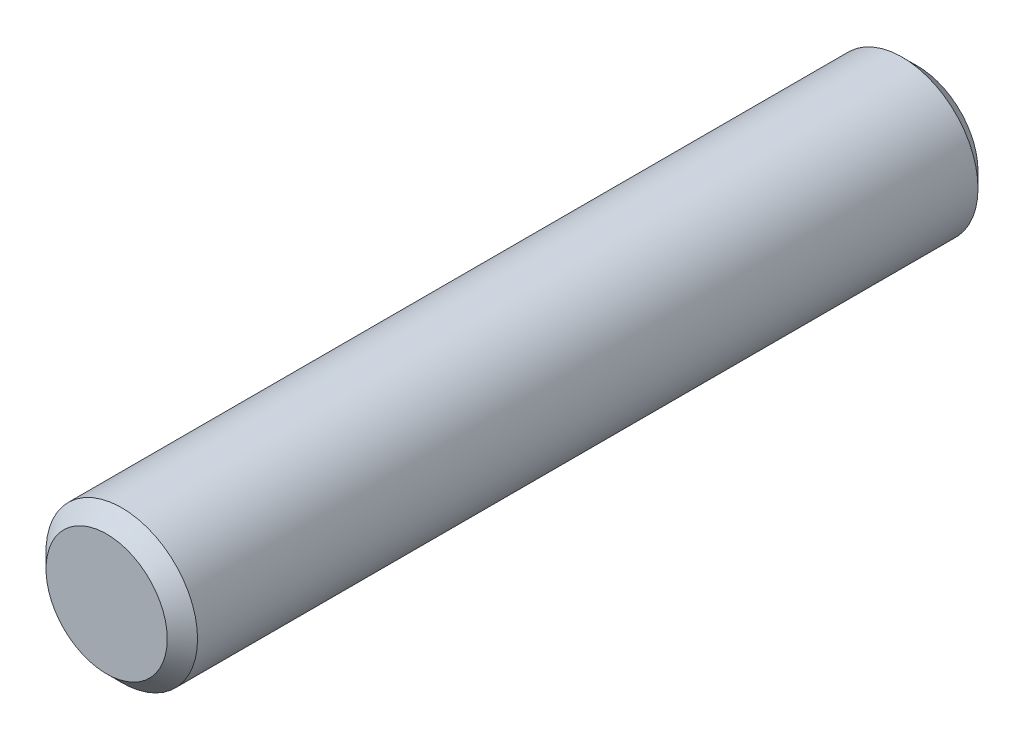
ISO-10303-21;
HEADER;
FILE_DESCRIPTION(('STEP AP214'),'2;1');
FILE_NAME('part.step','',(''),(''),'','','');
FILE_SCHEMA(('AUTOMOTIVE_DESIGN { 1 0 10303 214 1 1 1 1 }'));
ENDSEC;
DATA;
#1=APPLICATION_CONTEXT('core data for automotive mechanical design processes');
#2=APPLICATION_PROTOCOL_DEFINITION('international standard','automotive_design',2000,#1);
#3=PRODUCT_CONTEXT('',#1,'mechanical');
#4=PRODUCT('Part','Part','',(#3));
#5=PRODUCT_RELATED_PRODUCT_CATEGORY('part','',(#4));
#6=PRODUCT_DEFINITION_FORMATION('','',#4);
#7=PRODUCT_DEFINITION_CONTEXT('part definition',#1,'design');
#8=PRODUCT_DEFINITION('design','',#6,#7);
#9=PRODUCT_DEFINITION_SHAPE('','',#8);
#10=(LENGTH_UNIT() NAMED_UNIT(*) SI_UNIT(.MILLI.,.METRE.));
#11=(NAMED_UNIT(*) PLANE_ANGLE_UNIT() SI_UNIT($,.RADIAN.));
#12=(NAMED_UNIT(*) SI_UNIT($,.STERADIAN.) SOLID_ANGLE_UNIT());
#13=UNCERTAINTY_MEASURE_WITH_UNIT(LENGTH_MEASURE(1.E-05),#10,'distance_accuracy_value','');
#14=(GEOMETRIC_REPRESENTATION_CONTEXT(3) GLOBAL_UNCERTAINTY_ASSIGNED_CONTEXT((#13)) GLOBAL_UNIT_ASSIGNED_CONTEXT((#10,
#11,#12)) REPRESENTATION_CONTEXT('',''));
#15=CARTESIAN_POINT('',(0.,0.,0.));
#16=DIRECTION('',(0.,0.,1.));
#17=DIRECTION('',(1.,0.,0.));
#18=AXIS2_PLACEMENT_3D('',#15,#16,#17);
#19=CARTESIAN_POINT('',(0.,0.,42.4625));
#20=DIRECTION('',(0.,0.,-1.));
#21=DIRECTION('',(-1.,0.,0.));
#22=AXIS2_PLACEMENT_3D('',#19,#20,#21);
#23=CYLINDRICAL_SURFACE('',#22,7.9375);
#24=CARTESIAN_POINT('',(0.,0.,-40.8749999999999));
#25=DIRECTION('',(0.,0.,1.));
#26=DIRECTION('',(1.,0.,0.));
#27=AXIS2_PLACEMENT_3D('',#24,#25,#26);
#28=CIRCLE('',#27,7.9375);
#29=CARTESIAN_POINT('',(7.9375,0.,-40.8749999999999));
#30=VERTEX_POINT('',#29);
#31=EDGE_CURVE('E58',#30,#30,#28,.T.);
#32=ORIENTED_EDGE('',*,*,#31,.T.);
#33=EDGE_LOOP('',(#32));
#34=FACE_BOUND('',#33,.T.);
#35=CARTESIAN_POINT('',(0.,0.,40.875));
#36=DIRECTION('',(0.,0.,1.));
#37=DIRECTION('',(1.,0.,0.));
#38=AXIS2_PLACEMENT_3D('',#35,#36,#37);
#39=CIRCLE('',#38,7.9375);
#40=CARTESIAN_POINT('',(7.9375,0.,40.875));
#41=VERTEX_POINT('',#40);
#42=EDGE_CURVE('E63',#41,#41,#39,.F.);
#43=ORIENTED_EDGE('',*,*,#42,.T.);
#44=EDGE_LOOP('',(#43));
#45=FACE_BOUND('',#44,.T.);
#46=ADVANCED_FACE('F45',(#34,#45),#23,.T.);
#47=CARTESIAN_POINT('',(0.,0.,42.4625));
#48=DIRECTION('',(0.,0.,1.));
#49=DIRECTION('',(1.,0.,0.));
#50=AXIS2_PLACEMENT_3D('',#47,#48,#49);
#51=PLANE('',#50);
#52=CARTESIAN_POINT('',(0.,0.,42.4625));
#53=DIRECTION('',(0.,0.,1.));
#54=DIRECTION('',(1.,0.,0.));
#55=AXIS2_PLACEMENT_3D('',#52,#53,#54);
#56=CIRCLE('',#55,6.35000000000003);
#57=CARTESIAN_POINT('',(6.35000000000003,0.,42.4625));
#58=VERTEX_POINT('',#57);
#59=EDGE_CURVE('E10',#58,#58,#56,.T.);
#60=ORIENTED_EDGE('',*,*,#59,.T.);
#61=EDGE_LOOP('',(#60));
#62=FACE_BOUND('',#61,.T.);
#63=ADVANCED_FACE('F80',(#62),#51,.T.);
#64=CARTESIAN_POINT('',(0.,0.,-42.4625));
#65=DIRECTION('',(0.,0.,1.));
#66=DIRECTION('',(1.,0.,0.));
#67=AXIS2_PLACEMENT_3D('',#64,#65,#66);
#68=PLANE('',#67);
#69=CARTESIAN_POINT('',(0.,0.,-42.4625));
#70=DIRECTION('',(0.,0.,1.));
#71=DIRECTION('',(1.,0.,0.));
#72=AXIS2_PLACEMENT_3D('',#69,#70,#71);
#73=CIRCLE('',#72,6.3499999999999);
#74=CARTESIAN_POINT('',(6.3499999999999,0.,-42.4625));
#75=VERTEX_POINT('',#74);
#76=EDGE_CURVE('E53',#75,#75,#73,.F.);
#77=ORIENTED_EDGE('',*,*,#76,.T.);
#78=EDGE_LOOP('',(#77));
#79=FACE_BOUND('',#78,.T.);
#80=ADVANCED_FACE('F77',(#79),#68,.F.);
#81=CARTESIAN_POINT('',(0.,0.,-40.8749999999999));
#82=DIRECTION('',(0.,0.,1.));
#83=DIRECTION('',(1.,0.,0.));
#84=AXIS2_PLACEMENT_3D('',#81,#82,#83);
#85=CONICAL_SURFACE('',#84,7.9375,0.78539816339745);
#86=ORIENTED_EDGE('',*,*,#76,.F.);
#87=EDGE_LOOP('',(#86));
#88=FACE_BOUND('',#87,.T.);
#89=ORIENTED_EDGE('',*,*,#31,.F.);
#90=EDGE_LOOP('',(#89));
#91=FACE_BOUND('',#90,.T.);
#92=ADVANCED_FACE('F73',(#88,#91),#85,.T.);
#93=CARTESIAN_POINT('',(0.,0.,42.4625));
#94=DIRECTION('',(0.,0.,-1.));
#95=DIRECTION('',(-1.,0.,0.));
#96=AXIS2_PLACEMENT_3D('',#93,#94,#95);
#97=CONICAL_SURFACE('',#96,6.35000000000003,0.785398163397445);
#98=ORIENTED_EDGE('',*,*,#42,.F.);
#99=EDGE_LOOP('',(#98));
#100=FACE_BOUND('',#99,.T.);
#101=ORIENTED_EDGE('',*,*,#59,.F.);
#102=EDGE_LOOP('',(#101));
#103=FACE_BOUND('',#102,.T.);
#104=ADVANCED_FACE('F47',(#100,#103),#97,.T.);
#105=CLOSED_SHELL('',(#46,#63,#80,#92,#104));
#106=MANIFOLD_SOLID_BREP('B2',#105);
#107=ADVANCED_BREP_SHAPE_REPRESENTATION('',(#18,#106),#14);
#108=SHAPE_DEFINITION_REPRESENTATION(#9,#107);
ENDSEC;
END-ISO-10303-21;
